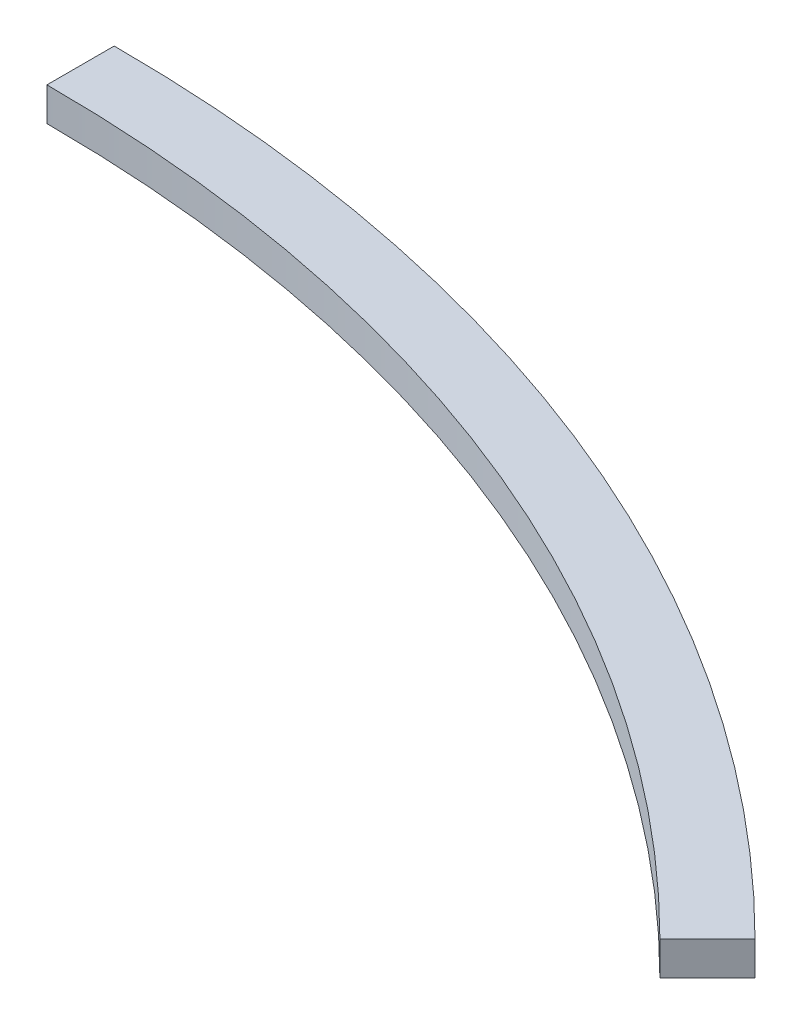
ISO-10303-21;
HEADER;
FILE_DESCRIPTION(('STEP AP214'),'2;1');
FILE_NAME('part.step','',(''),(''),'','','');
FILE_SCHEMA(('AUTOMOTIVE_DESIGN { 1 0 10303 214 1 1 1 1 }'));
ENDSEC;
DATA;
#1=APPLICATION_CONTEXT('core data for automotive mechanical design processes');
#2=APPLICATION_PROTOCOL_DEFINITION('international standard','automotive_design',2000,#1);
#3=PRODUCT_CONTEXT('',#1,'mechanical');
#4=PRODUCT('Part','Part','',(#3));
#5=PRODUCT_RELATED_PRODUCT_CATEGORY('part','',(#4));
#6=PRODUCT_DEFINITION_FORMATION('','',#4);
#7=PRODUCT_DEFINITION_CONTEXT('part definition',#1,'design');
#8=PRODUCT_DEFINITION('design','',#6,#7);
#9=PRODUCT_DEFINITION_SHAPE('','',#8);
#10=(LENGTH_UNIT() NAMED_UNIT(*) SI_UNIT(.MILLI.,.METRE.));
#11=(NAMED_UNIT(*) PLANE_ANGLE_UNIT() SI_UNIT($,.RADIAN.));
#12=(NAMED_UNIT(*) SI_UNIT($,.STERADIAN.) SOLID_ANGLE_UNIT());
#13=UNCERTAINTY_MEASURE_WITH_UNIT(LENGTH_MEASURE(1.E-05),#10,'distance_accuracy_value','');
#14=(GEOMETRIC_REPRESENTATION_CONTEXT(3) GLOBAL_UNCERTAINTY_ASSIGNED_CONTEXT((#13)) GLOBAL_UNIT_ASSIGNED_CONTEXT((#10,
#11,#12)) REPRESENTATION_CONTEXT('',''));
#15=CARTESIAN_POINT('',(0.,0.,0.));
#16=DIRECTION('',(0.,0.,1.));
#17=DIRECTION('',(1.,0.,0.));
#18=AXIS2_PLACEMENT_3D('',#15,#16,#17);
#19=CARTESIAN_POINT('',(0.,10.,0.));
#20=DIRECTION('',(0.,-1.,0.));
#21=DIRECTION('',(0.,0.,-1.));
#22=AXIS2_PLACEMENT_3D('',#19,#20,#21);
#23=CYLINDRICAL_SURFACE('',#22,460.);
#24=CARTESIAN_POINT('',(0.,0.,0.));
#25=DIRECTION('',(0.,1.,0.));
#26=DIRECTION('',(0.,0.,1.));
#27=AXIS2_PLACEMENT_3D('',#24,#25,#26);
#28=CIRCLE('',#27,460.);
#29=CARTESIAN_POINT('',(0.,0.,-460.));
#30=VERTEX_POINT('',#29);
#31=CARTESIAN_POINT('',(325.269119345812,0.,-325.269119345811));
#32=VERTEX_POINT('',#31);
#33=EDGE_CURVE('E99',#30,#32,#28,.F.);
#34=ORIENTED_EDGE('',*,*,#33,.F.);
#35=DIRECTION('',(0.,-1.,0.));
#36=VECTOR('',#35,1.);
#37=CARTESIAN_POINT('',(0.,10.,-460.));
#38=LINE('',#37,#36);
#39=CARTESIAN_POINT('',(0.,10.,-460.));
#40=VERTEX_POINT('',#39);
#41=EDGE_CURVE('E11',#40,#30,#38,.T.);
#42=ORIENTED_EDGE('',*,*,#41,.F.);
#43=CARTESIAN_POINT('',(0.,10.,0.));
#44=DIRECTION('',(0.,1.,0.));
#45=DIRECTION('',(0.,0.,1.));
#46=AXIS2_PLACEMENT_3D('',#43,#44,#45);
#47=CIRCLE('',#46,460.);
#48=CARTESIAN_POINT('',(325.269119345812,10.,-325.269119345811));
#49=VERTEX_POINT('',#48);
#50=EDGE_CURVE('E93',#40,#49,#47,.F.);
#51=ORIENTED_EDGE('',*,*,#50,.T.);
#52=DIRECTION('',(0.,-1.,0.));
#53=VECTOR('',#52,1.);
#54=CARTESIAN_POINT('',(325.269119345812,10.,-325.269119345811));
#55=LINE('',#54,#53);
#56=EDGE_CURVE('E74',#49,#32,#55,.T.);
#57=ORIENTED_EDGE('',*,*,#56,.T.);
#58=EDGE_LOOP('',(#34,#42,#51,#57));
#59=FACE_BOUND('',#58,.T.);
#60=ADVANCED_FACE('F36',(#59),#23,.T.);
#61=CARTESIAN_POINT('',(0.,10.,0.));
#62=DIRECTION('',(-1.,0.,0.));
#63=DIRECTION('',(0.,0.,1.));
#64=AXIS2_PLACEMENT_3D('',#61,#62,#63);
#65=PLANE('',#64);
#66=DIRECTION('',(0.,0.,-1.));
#67=VECTOR('',#66,1.);
#68=CARTESIAN_POINT('',(0.,0.,0.));
#69=LINE('',#68,#67);
#70=CARTESIAN_POINT('',(0.,0.,-440.));
#71=VERTEX_POINT('',#70);
#72=EDGE_CURVE('E87',#71,#30,#69,.T.);
#73=ORIENTED_EDGE('',*,*,#72,.F.);
#74=DIRECTION('',(0.,-1.,0.));
#75=VECTOR('',#74,1.);
#76=CARTESIAN_POINT('',(0.,10.,-440.));
#77=LINE('',#76,#75);
#78=CARTESIAN_POINT('',(0.,10.,-440.));
#79=VERTEX_POINT('',#78);
#80=EDGE_CURVE('E44',#79,#71,#77,.T.);
#81=ORIENTED_EDGE('',*,*,#80,.F.);
#82=DIRECTION('',(0.,0.,-1.));
#83=VECTOR('',#82,1.);
#84=CARTESIAN_POINT('',(0.,10.,0.));
#85=LINE('',#84,#83);
#86=EDGE_CURVE('E85',#79,#40,#85,.T.);
#87=ORIENTED_EDGE('',*,*,#86,.T.);
#88=ORIENTED_EDGE('',*,*,#41,.T.);
#89=EDGE_LOOP('',(#73,#81,#87,#88));
#90=FACE_BOUND('',#89,.T.);
#91=ADVANCED_FACE('F83',(#90),#65,.T.);
#92=CARTESIAN_POINT('',(0.,10.,0.));
#93=DIRECTION('',(0.,-1.,0.));
#94=DIRECTION('',(0.,0.,-1.));
#95=AXIS2_PLACEMENT_3D('',#92,#93,#94);
#96=CYLINDRICAL_SURFACE('',#95,440.);
#97=CARTESIAN_POINT('',(0.,0.,0.));
#98=DIRECTION('',(0.,1.,0.));
#99=DIRECTION('',(0.,0.,1.));
#100=AXIS2_PLACEMENT_3D('',#97,#98,#99);
#101=CIRCLE('',#100,440.);
#102=CARTESIAN_POINT('',(311.126983722081,0.,-311.12698372208));
#103=VERTEX_POINT('',#102);
#104=EDGE_CURVE('E67',#71,#103,#101,.F.);
#105=ORIENTED_EDGE('',*,*,#104,.T.);
#106=DIRECTION('',(0.,-1.,0.));
#107=VECTOR('',#106,1.);
#108=CARTESIAN_POINT('',(311.126983722081,10.,-311.12698372208));
#109=LINE('',#108,#107);
#110=CARTESIAN_POINT('',(311.126983722081,10.,-311.12698372208));
#111=VERTEX_POINT('',#110);
#112=EDGE_CURVE('E88',#111,#103,#109,.T.);
#113=ORIENTED_EDGE('',*,*,#112,.F.);
#114=CARTESIAN_POINT('',(0.,10.,0.));
#115=DIRECTION('',(0.,1.,0.));
#116=DIRECTION('',(0.,0.,1.));
#117=AXIS2_PLACEMENT_3D('',#114,#115,#116);
#118=CIRCLE('',#117,440.);
#119=EDGE_CURVE('E89',#79,#111,#118,.F.);
#120=ORIENTED_EDGE('',*,*,#119,.F.);
#121=ORIENTED_EDGE('',*,*,#80,.T.);
#122=EDGE_LOOP('',(#105,#113,#120,#121));
#123=FACE_BOUND('',#122,.T.);
#124=ADVANCED_FACE('F90',(#123),#96,.F.);
#125=CARTESIAN_POINT('',(-7.85046229341884E-13,10.,-7.85046229341891E-13));
#126=DIRECTION('',(-0.707106781186545,0.,-0.70710678118655));
#127=DIRECTION('',(-0.70710678118655,0.,0.707106781186545));
#128=AXIS2_PLACEMENT_3D('',#125,#126,#127);
#129=PLANE('',#128);
#130=DIRECTION('',(0.70710678118655,0.,-0.707106781186545));
#131=VECTOR('',#130,1.);
#132=CARTESIAN_POINT('',(-7.85046229341884E-13,0.,-7.85046229341891E-13));
#133=LINE('',#132,#131);
#134=EDGE_CURVE('E95',#103,#32,#133,.T.);
#135=ORIENTED_EDGE('',*,*,#134,.T.);
#136=ORIENTED_EDGE('',*,*,#56,.F.);
#137=DIRECTION('',(0.70710678118655,0.,-0.707106781186545));
#138=VECTOR('',#137,1.);
#139=CARTESIAN_POINT('',(-7.85046229341884E-13,10.,-7.85046229341891E-13));
#140=LINE('',#139,#138);
#141=EDGE_CURVE('E52',#111,#49,#140,.T.);
#142=ORIENTED_EDGE('',*,*,#141,.F.);
#143=ORIENTED_EDGE('',*,*,#112,.T.);
#144=EDGE_LOOP('',(#135,#136,#142,#143));
#145=FACE_BOUND('',#144,.T.);
#146=ADVANCED_FACE('F108',(#145),#129,.F.);
#147=CARTESIAN_POINT('',(0.,10.,0.));
#148=DIRECTION('',(0.,1.,0.));
#149=DIRECTION('',(0.,0.,1.));
#150=AXIS2_PLACEMENT_3D('',#147,#148,#149);
#151=PLANE('',#150);
#152=ORIENTED_EDGE('',*,*,#50,.F.);
#153=ORIENTED_EDGE('',*,*,#86,.F.);
#154=ORIENTED_EDGE('',*,*,#119,.T.);
#155=ORIENTED_EDGE('',*,*,#141,.T.);
#156=EDGE_LOOP('',(#152,#153,#154,#155));
#157=FACE_BOUND('',#156,.T.);
#158=ADVANCED_FACE('F92',(#157),#151,.T.);
#159=CARTESIAN_POINT('',(0.,0.,0.));
#160=DIRECTION('',(0.,1.,0.));
#161=DIRECTION('',(0.,0.,1.));
#162=AXIS2_PLACEMENT_3D('',#159,#160,#161);
#163=PLANE('',#162);
#164=ORIENTED_EDGE('',*,*,#33,.T.);
#165=ORIENTED_EDGE('',*,*,#134,.F.);
#166=ORIENTED_EDGE('',*,*,#104,.F.);
#167=ORIENTED_EDGE('',*,*,#72,.T.);
#168=EDGE_LOOP('',(#164,#165,#166,#167));
#169=FACE_BOUND('',#168,.T.);
#170=ADVANCED_FACE('F110',(#169),#163,.F.);
#171=CLOSED_SHELL('',(#60,#91,#124,#146,#158,#170));
#172=MANIFOLD_SOLID_BREP('B2',#171);
#173=ADVANCED_BREP_SHAPE_REPRESENTATION('',(#18,#172),#14);
#174=SHAPE_DEFINITION_REPRESENTATION(#9,#173);
ENDSEC;
END-ISO-10303-21;
